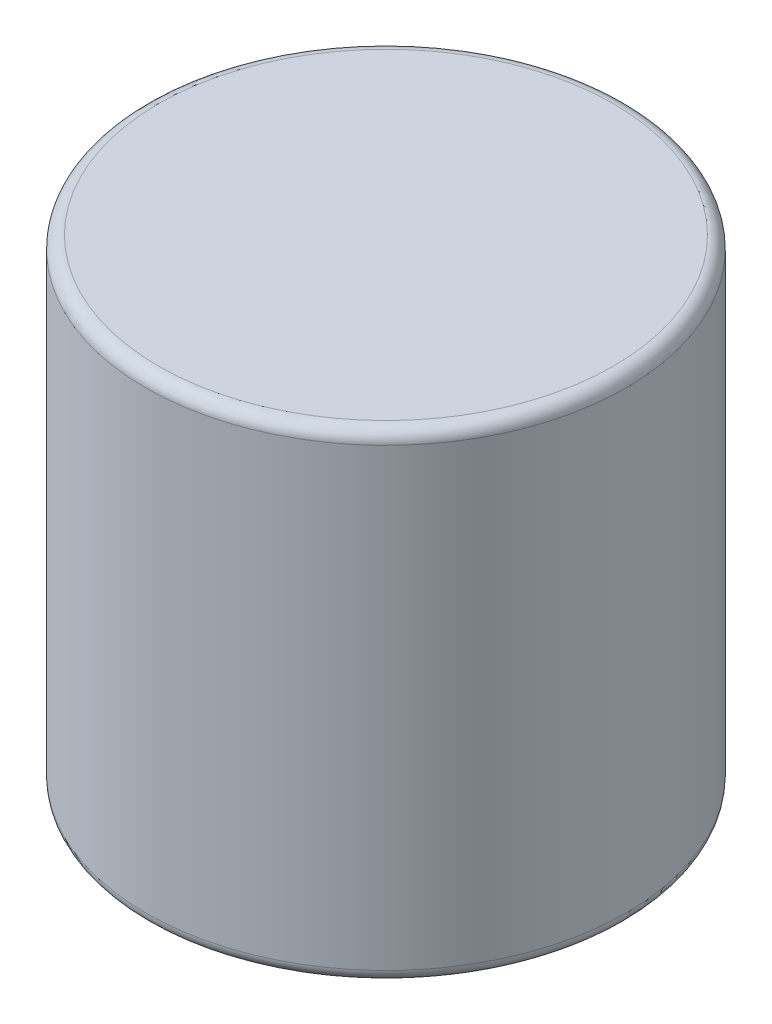
ISO-10303-21;
HEADER;
FILE_DESCRIPTION(('STEP AP214'),'2;1');
FILE_NAME('part.step','',(''),(''),'','','');
FILE_SCHEMA(('AUTOMOTIVE_DESIGN { 1 0 10303 214 1 1 1 1 }'));
ENDSEC;
DATA;
#1=APPLICATION_CONTEXT('core data for automotive mechanical design processes');
#2=APPLICATION_PROTOCOL_DEFINITION('international standard','automotive_design',2000,#1);
#3=PRODUCT_CONTEXT('',#1,'mechanical');
#4=PRODUCT('Part','Part','',(#3));
#5=PRODUCT_RELATED_PRODUCT_CATEGORY('part','',(#4));
#6=PRODUCT_DEFINITION_FORMATION('','',#4);
#7=PRODUCT_DEFINITION_CONTEXT('part definition',#1,'design');
#8=PRODUCT_DEFINITION('design','',#6,#7);
#9=PRODUCT_DEFINITION_SHAPE('','',#8);
#10=(LENGTH_UNIT() NAMED_UNIT(*) SI_UNIT(.MILLI.,.METRE.));
#11=(NAMED_UNIT(*) PLANE_ANGLE_UNIT() SI_UNIT($,.RADIAN.));
#12=(NAMED_UNIT(*) SI_UNIT($,.STERADIAN.) SOLID_ANGLE_UNIT());
#13=UNCERTAINTY_MEASURE_WITH_UNIT(LENGTH_MEASURE(1.E-05),#10,'distance_accuracy_value','');
#14=(GEOMETRIC_REPRESENTATION_CONTEXT(3) GLOBAL_UNCERTAINTY_ASSIGNED_CONTEXT((#13)) GLOBAL_UNIT_ASSIGNED_CONTEXT((#10,
#11,#12)) REPRESENTATION_CONTEXT('',''));
#15=CARTESIAN_POINT('',(0.,0.,0.));
#16=DIRECTION('',(0.,0.,1.));
#17=DIRECTION('',(1.,0.,0.));
#18=AXIS2_PLACEMENT_3D('',#15,#16,#17);
#19=CARTESIAN_POINT('',(0.,9.525,0.));
#20=DIRECTION('',(0.,-1.,0.));
#21=DIRECTION('',(0.,0.,-1.));
#22=AXIS2_PLACEMENT_3D('',#19,#20,#21);
#23=CYLINDRICAL_SURFACE('',#22,4.7625);
#24=CARTESIAN_POINT('',(0.,0.25,0.));
#25=DIRECTION('',(0.,1.,0.));
#26=DIRECTION('',(0.,0.,1.));
#27=AXIS2_PLACEMENT_3D('',#24,#25,#26);
#28=CIRCLE('',#27,4.7625);
#29=CARTESIAN_POINT('',(0.,0.25,4.7625));
#30=VERTEX_POINT('',#29);
#31=EDGE_CURVE('E43',#30,#30,#28,.T.);
#32=ORIENTED_EDGE('',*,*,#31,.T.);
#33=EDGE_LOOP('',(#32));
#34=FACE_BOUND('',#33,.T.);
#35=CARTESIAN_POINT('',(0.,9.275,0.));
#36=DIRECTION('',(0.,1.,0.));
#37=DIRECTION('',(0.,0.,1.));
#38=AXIS2_PLACEMENT_3D('',#35,#36,#37);
#39=CIRCLE('',#38,4.7625);
#40=CARTESIAN_POINT('',(0.,9.275,4.7625));
#41=VERTEX_POINT('',#40);
#42=EDGE_CURVE('E47',#41,#41,#39,.F.);
#43=ORIENTED_EDGE('',*,*,#42,.T.);
#44=EDGE_LOOP('',(#43));
#45=FACE_BOUND('',#44,.T.);
#46=ADVANCED_FACE('F32',(#34,#45),#23,.T.);
#47=CARTESIAN_POINT('',(0.,9.525,0.));
#48=DIRECTION('',(0.,1.,0.));
#49=DIRECTION('',(0.,0.,1.));
#50=AXIS2_PLACEMENT_3D('',#47,#48,#49);
#51=PLANE('',#50);
#52=CARTESIAN_POINT('',(0.,9.525,0.));
#53=DIRECTION('',(0.,1.,0.));
#54=DIRECTION('',(0.,0.,1.));
#55=AXIS2_PLACEMENT_3D('',#52,#53,#54);
#56=CIRCLE('',#55,4.5125);
#57=CARTESIAN_POINT('',(0.,9.525,4.5125));
#58=VERTEX_POINT('',#57);
#59=EDGE_CURVE('E10',#58,#58,#56,.T.);
#60=ORIENTED_EDGE('',*,*,#59,.T.);
#61=EDGE_LOOP('',(#60));
#62=FACE_BOUND('',#61,.T.);
#63=ADVANCED_FACE('F63',(#62),#51,.T.);
#64=CARTESIAN_POINT('',(0.,0.,0.));
#65=DIRECTION('',(0.,1.,0.));
#66=DIRECTION('',(0.,0.,1.));
#67=AXIS2_PLACEMENT_3D('',#64,#65,#66);
#68=PLANE('',#67);
#69=CARTESIAN_POINT('',(0.,0.,0.));
#70=DIRECTION('',(0.,1.,0.));
#71=DIRECTION('',(0.,0.,1.));
#72=AXIS2_PLACEMENT_3D('',#69,#70,#71);
#73=CIRCLE('',#72,4.5125);
#74=CARTESIAN_POINT('',(0.,0.,4.5125));
#75=VERTEX_POINT('',#74);
#76=EDGE_CURVE('E39',#75,#75,#73,.F.);
#77=ORIENTED_EDGE('',*,*,#76,.T.);
#78=EDGE_LOOP('',(#77));
#79=FACE_BOUND('',#78,.T.);
#80=ADVANCED_FACE('F60',(#79),#68,.F.);
#81=CARTESIAN_POINT('',(0.,0.25,0.));
#82=DIRECTION('',(0.,1.,0.));
#83=DIRECTION('',(0.,0.,1.));
#84=AXIS2_PLACEMENT_3D('',#81,#82,#83);
#85=TOROIDAL_SURFACE('',#84,4.5125,0.25);
#86=ORIENTED_EDGE('',*,*,#76,.F.);
#87=EDGE_LOOP('',(#86));
#88=FACE_BOUND('',#87,.T.);
#89=ORIENTED_EDGE('',*,*,#31,.F.);
#90=EDGE_LOOP('',(#89));
#91=FACE_BOUND('',#90,.T.);
#92=ADVANCED_FACE('F56',(#88,#91),#85,.T.);
#93=CARTESIAN_POINT('',(0.,9.275,0.));
#94=DIRECTION('',(0.,1.,0.));
#95=DIRECTION('',(0.,0.,1.));
#96=AXIS2_PLACEMENT_3D('',#93,#94,#95);
#97=TOROIDAL_SURFACE('',#96,4.5125,0.25);
#98=ORIENTED_EDGE('',*,*,#42,.F.);
#99=EDGE_LOOP('',(#98));
#100=FACE_BOUND('',#99,.T.);
#101=ORIENTED_EDGE('',*,*,#59,.F.);
#102=EDGE_LOOP('',(#101));
#103=FACE_BOUND('',#102,.T.);
#104=ADVANCED_FACE('F34',(#100,#103),#97,.T.);
#105=CLOSED_SHELL('',(#46,#63,#80,#92,#104));
#106=MANIFOLD_SOLID_BREP('B2',#105);
#107=ADVANCED_BREP_SHAPE_REPRESENTATION('',(#18,#106),#14);
#108=SHAPE_DEFINITION_REPRESENTATION(#9,#107);
ENDSEC;
END-ISO-10303-21;
